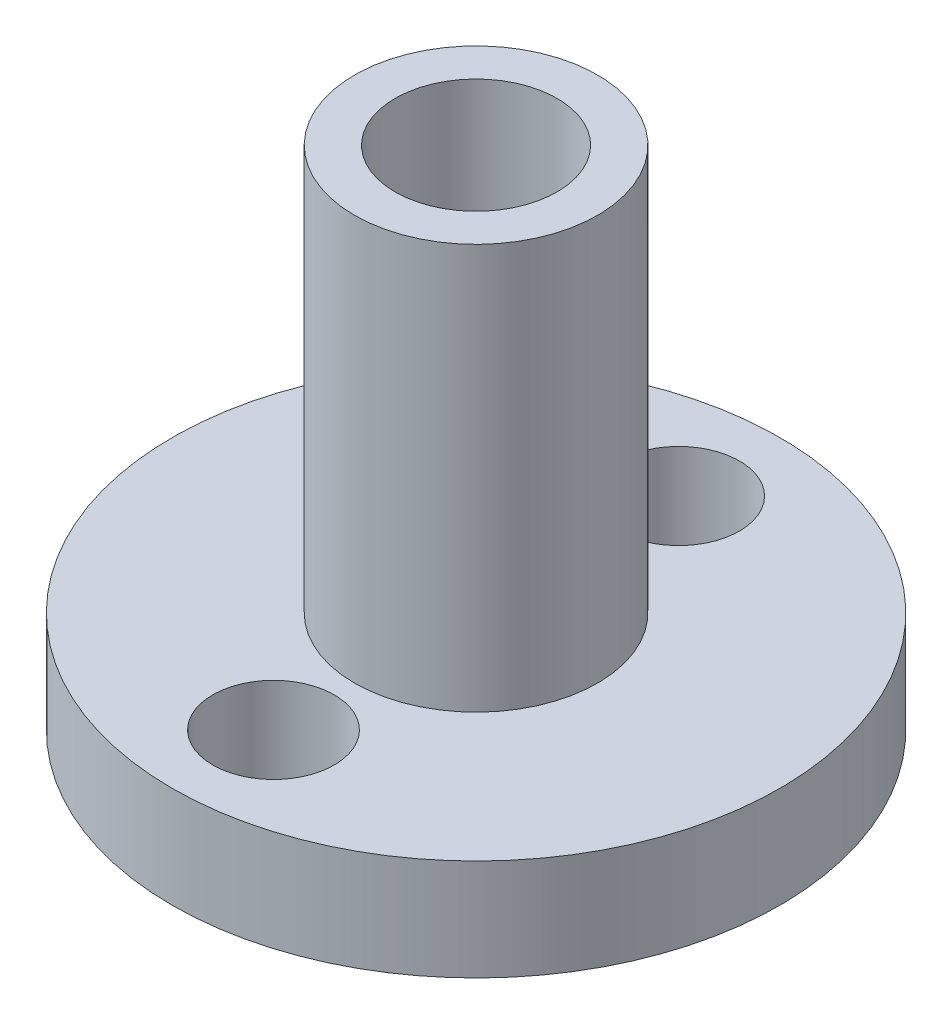
ISO-10303-21;
HEADER;
FILE_DESCRIPTION(('STEP AP214'),'2;1');
FILE_NAME('part.step','',(''),(''),'','','');
FILE_SCHEMA(('AUTOMOTIVE_DESIGN { 1 0 10303 214 1 1 1 1 }'));
ENDSEC;
DATA;
#1=APPLICATION_CONTEXT('core data for automotive mechanical design processes');
#2=APPLICATION_PROTOCOL_DEFINITION('international standard','automotive_design',2000,#1);
#3=PRODUCT_CONTEXT('',#1,'mechanical');
#4=PRODUCT('Part','Part','',(#3));
#5=PRODUCT_RELATED_PRODUCT_CATEGORY('part','',(#4));
#6=PRODUCT_DEFINITION_FORMATION('','',#4);
#7=PRODUCT_DEFINITION_CONTEXT('part definition',#1,'design');
#8=PRODUCT_DEFINITION('design','',#6,#7);
#9=PRODUCT_DEFINITION_SHAPE('','',#8);
#10=(LENGTH_UNIT() NAMED_UNIT(*) SI_UNIT(.MILLI.,.METRE.));
#11=(NAMED_UNIT(*) PLANE_ANGLE_UNIT() SI_UNIT($,.RADIAN.));
#12=(NAMED_UNIT(*) SI_UNIT($,.STERADIAN.) SOLID_ANGLE_UNIT());
#13=UNCERTAINTY_MEASURE_WITH_UNIT(LENGTH_MEASURE(1.E-05),#10,'distance_accuracy_value','');
#14=(GEOMETRIC_REPRESENTATION_CONTEXT(3) GLOBAL_UNCERTAINTY_ASSIGNED_CONTEXT((#13)) GLOBAL_UNIT_ASSIGNED_CONTEXT((#10,
#11,#12)) REPRESENTATION_CONTEXT('',''));
#15=CARTESIAN_POINT('',(0.,0.,0.));
#16=DIRECTION('',(0.,0.,1.));
#17=DIRECTION('',(1.,0.,0.));
#18=AXIS2_PLACEMENT_3D('',#15,#16,#17);
#19=CARTESIAN_POINT('',(0.,5.,0.));
#20=DIRECTION('',(0.,1.,0.));
#21=DIRECTION('',(0.,0.,1.));
#22=AXIS2_PLACEMENT_3D('',#19,#20,#21);
#23=PLANE('',#22);
#24=CARTESIAN_POINT('',(0.,5.,0.));
#25=DIRECTION('',(0.,1.,0.));
#26=DIRECTION('',(0.,0.,1.));
#27=AXIS2_PLACEMENT_3D('',#24,#25,#26);
#28=CIRCLE('',#27,6.);
#29=CARTESIAN_POINT('',(0.,5.,6.));
#30=VERTEX_POINT('',#29);
#31=EDGE_CURVE('E62',#30,#30,#28,.T.);
#32=ORIENTED_EDGE('',*,*,#31,.F.);
#33=EDGE_LOOP('',(#32));
#34=FACE_BOUND('',#33,.T.);
#35=CARTESIAN_POINT('',(0.,5.,-10.));
#36=DIRECTION('',(0.,1.,0.));
#37=DIRECTION('',(0.,0.,1.));
#38=AXIS2_PLACEMENT_3D('',#35,#36,#37);
#39=CIRCLE('',#38,3.);
#40=CARTESIAN_POINT('',(0.,5.,-7.));
#41=VERTEX_POINT('',#40);
#42=EDGE_CURVE('E48',#41,#41,#39,.T.);
#43=ORIENTED_EDGE('',*,*,#42,.F.);
#44=EDGE_LOOP('',(#43));
#45=FACE_BOUND('',#44,.T.);
#46=CARTESIAN_POINT('',(0.,5.,0.));
#47=DIRECTION('',(0.,1.,0.));
#48=DIRECTION('',(0.,0.,1.));
#49=AXIS2_PLACEMENT_3D('',#46,#47,#48);
#50=CIRCLE('',#49,15.);
#51=CARTESIAN_POINT('',(0.,5.,15.));
#52=VERTEX_POINT('',#51);
#53=EDGE_CURVE('E39',#52,#52,#50,.T.);
#54=ORIENTED_EDGE('',*,*,#53,.T.);
#55=EDGE_LOOP('',(#54));
#56=FACE_BOUND('',#55,.T.);
#57=CARTESIAN_POINT('',(0.,5.,10.));
#58=DIRECTION('',(0.,1.,0.));
#59=DIRECTION('',(0.,0.,1.));
#60=AXIS2_PLACEMENT_3D('',#57,#58,#59);
#61=CIRCLE('',#60,3.);
#62=CARTESIAN_POINT('',(0.,5.,13.));
#63=VERTEX_POINT('',#62);
#64=EDGE_CURVE('E53',#63,#63,#61,.T.);
#65=ORIENTED_EDGE('',*,*,#64,.F.);
#66=EDGE_LOOP('',(#65));
#67=FACE_BOUND('',#66,.T.);
#68=ADVANCED_FACE('F32',(#34,#45,#56,#67),#23,.T.);
#69=CARTESIAN_POINT('',(0.,0.,0.));
#70=DIRECTION('',(0.,1.,0.));
#71=DIRECTION('',(0.,0.,1.));
#72=AXIS2_PLACEMENT_3D('',#69,#70,#71);
#73=PLANE('',#72);
#74=CARTESIAN_POINT('',(0.,0.,0.));
#75=DIRECTION('',(0.,1.,0.));
#76=DIRECTION('',(0.,0.,1.));
#77=AXIS2_PLACEMENT_3D('',#74,#75,#76);
#78=CIRCLE('',#77,15.);
#79=CARTESIAN_POINT('',(0.,0.,15.));
#80=VERTEX_POINT('',#79);
#81=EDGE_CURVE('E43',#80,#80,#78,.T.);
#82=ORIENTED_EDGE('',*,*,#81,.F.);
#83=EDGE_LOOP('',(#82));
#84=FACE_BOUND('',#83,.T.);
#85=CARTESIAN_POINT('',(0.,0.,-10.));
#86=DIRECTION('',(0.,1.,0.));
#87=DIRECTION('',(0.,0.,1.));
#88=AXIS2_PLACEMENT_3D('',#85,#86,#87);
#89=CIRCLE('',#88,3.);
#90=CARTESIAN_POINT('',(0.,0.,-7.));
#91=VERTEX_POINT('',#90);
#92=EDGE_CURVE('E50',#91,#91,#89,.T.);
#93=ORIENTED_EDGE('',*,*,#92,.T.);
#94=EDGE_LOOP('',(#93));
#95=FACE_BOUND('',#94,.T.);
#96=CARTESIAN_POINT('',(0.,0.,10.));
#97=DIRECTION('',(0.,1.,0.));
#98=DIRECTION('',(0.,0.,1.));
#99=AXIS2_PLACEMENT_3D('',#96,#97,#98);
#100=CIRCLE('',#99,3.);
#101=CARTESIAN_POINT('',(0.,0.,13.));
#102=VERTEX_POINT('',#101);
#103=EDGE_CURVE('E56',#102,#102,#100,.T.);
#104=ORIENTED_EDGE('',*,*,#103,.T.);
#105=EDGE_LOOP('',(#104));
#106=FACE_BOUND('',#105,.T.);
#107=ADVANCED_FACE('F90',(#84,#95,#106),#73,.F.);
#108=CARTESIAN_POINT('',(0.,5.,0.));
#109=DIRECTION('',(0.,-1.,0.));
#110=DIRECTION('',(0.,0.,-1.));
#111=AXIS2_PLACEMENT_3D('',#108,#109,#110);
#112=CYLINDRICAL_SURFACE('',#111,15.);
#113=ORIENTED_EDGE('',*,*,#53,.F.);
#114=EDGE_LOOP('',(#113));
#115=FACE_BOUND('',#114,.T.);
#116=ORIENTED_EDGE('',*,*,#81,.T.);
#117=EDGE_LOOP('',(#116));
#118=FACE_BOUND('',#117,.T.);
#119=ADVANCED_FACE('F34',(#115,#118),#112,.T.);
#120=CARTESIAN_POINT('',(0.,5.,-10.));
#121=DIRECTION('',(0.,-1.,0.));
#122=DIRECTION('',(0.,0.,-1.));
#123=AXIS2_PLACEMENT_3D('',#120,#121,#122);
#124=CYLINDRICAL_SURFACE('',#123,3.);
#125=ORIENTED_EDGE('',*,*,#42,.T.);
#126=EDGE_LOOP('',(#125));
#127=FACE_BOUND('',#126,.T.);
#128=ORIENTED_EDGE('',*,*,#92,.F.);
#129=EDGE_LOOP('',(#128));
#130=FACE_BOUND('',#129,.T.);
#131=ADVANCED_FACE('F85',(#127,#130),#124,.F.);
#132=CARTESIAN_POINT('',(0.,5.,10.));
#133=DIRECTION('',(0.,-1.,0.));
#134=DIRECTION('',(0.,0.,-1.));
#135=AXIS2_PLACEMENT_3D('',#132,#133,#134);
#136=CYLINDRICAL_SURFACE('',#135,3.);
#137=ORIENTED_EDGE('',*,*,#64,.T.);
#138=EDGE_LOOP('',(#137));
#139=FACE_BOUND('',#138,.T.);
#140=ORIENTED_EDGE('',*,*,#103,.F.);
#141=EDGE_LOOP('',(#140));
#142=FACE_BOUND('',#141,.T.);
#143=ADVANCED_FACE('F76',(#139,#142),#136,.F.);
#144=CARTESIAN_POINT('',(0.,25.,0.));
#145=DIRECTION('',(0.,1.,0.));
#146=DIRECTION('',(0.,0.,1.));
#147=AXIS2_PLACEMENT_3D('',#144,#145,#146);
#148=PLANE('',#147);
#149=CARTESIAN_POINT('',(0.,25.,0.));
#150=DIRECTION('',(0.,1.,0.));
#151=DIRECTION('',(0.,0.,1.));
#152=AXIS2_PLACEMENT_3D('',#149,#150,#151);
#153=CIRCLE('',#152,6.);
#154=CARTESIAN_POINT('',(0.,25.,6.));
#155=VERTEX_POINT('',#154);
#156=EDGE_CURVE('E59',#155,#155,#153,.T.);
#157=ORIENTED_EDGE('',*,*,#156,.T.);
#158=EDGE_LOOP('',(#157));
#159=FACE_BOUND('',#158,.T.);
#160=CARTESIAN_POINT('',(0.,25.,0.));
#161=DIRECTION('',(0.,1.,0.));
#162=DIRECTION('',(0.,0.,1.));
#163=AXIS2_PLACEMENT_3D('',#160,#161,#162);
#164=CIRCLE('',#163,4.);
#165=CARTESIAN_POINT('',(0.,25.,4.));
#166=VERTEX_POINT('',#165);
#167=EDGE_CURVE('E65',#166,#166,#164,.T.);
#168=ORIENTED_EDGE('',*,*,#167,.F.);
#169=EDGE_LOOP('',(#168));
#170=FACE_BOUND('',#169,.T.);
#171=ADVANCED_FACE('F73',(#159,#170),#148,.T.);
#172=CARTESIAN_POINT('',(0.,25.,0.));
#173=DIRECTION('',(0.,-1.,0.));
#174=DIRECTION('',(0.,0.,-1.));
#175=AXIS2_PLACEMENT_3D('',#172,#173,#174);
#176=CYLINDRICAL_SURFACE('',#175,6.);
#177=ORIENTED_EDGE('',*,*,#156,.F.);
#178=EDGE_LOOP('',(#177));
#179=FACE_BOUND('',#178,.T.);
#180=ORIENTED_EDGE('',*,*,#31,.T.);
#181=EDGE_LOOP('',(#180));
#182=FACE_BOUND('',#181,.T.);
#183=ADVANCED_FACE('F75',(#179,#182),#176,.T.);
#184=CARTESIAN_POINT('',(0.,25.,0.));
#185=DIRECTION('',(0.,-1.,0.));
#186=DIRECTION('',(0.,0.,-1.));
#187=AXIS2_PLACEMENT_3D('',#184,#185,#186);
#188=CYLINDRICAL_SURFACE('',#187,4.);
#189=ORIENTED_EDGE('',*,*,#167,.T.);
#190=EDGE_LOOP('',(#189));
#191=FACE_BOUND('',#190,.T.);
#192=CARTESIAN_POINT('',(0.,5.,0.));
#193=DIRECTION('',(0.,1.,0.));
#194=DIRECTION('',(0.,0.,1.));
#195=AXIS2_PLACEMENT_3D('',#192,#193,#194);
#196=CIRCLE('',#195,4.);
#197=CARTESIAN_POINT('',(0.,5.,4.));
#198=VERTEX_POINT('',#197);
#199=EDGE_CURVE('E10',#198,#198,#196,.F.);
#200=ORIENTED_EDGE('',*,*,#199,.T.);
#201=EDGE_LOOP('',(#200));
#202=FACE_BOUND('',#201,.T.);
#203=ADVANCED_FACE('F71',(#191,#202),#188,.F.);
#204=ORIENTED_EDGE('',*,*,#199,.F.);
#205=EDGE_LOOP('',(#204));
#206=FACE_BOUND('',#205,.T.);
#207=ADVANCED_FACE('F93',(#206),#23,.T.);
#208=CLOSED_SHELL('',(#68,#107,#119,#131,#143,#171,#183,#203,#207));
#209=MANIFOLD_SOLID_BREP('B2',#208);
#210=ADVANCED_BREP_SHAPE_REPRESENTATION('',(#18,#209),#14);
#211=SHAPE_DEFINITION_REPRESENTATION(#9,#210);
ENDSEC;
END-ISO-10303-21;
